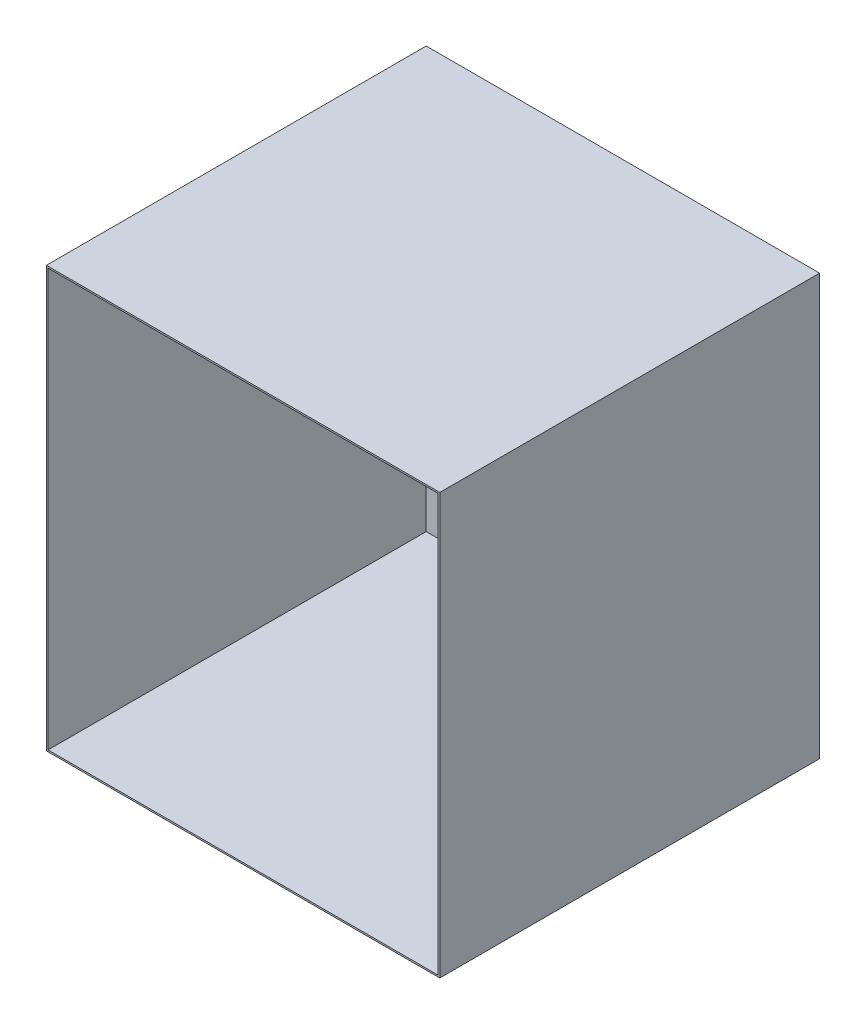
ISO-10303-21;
HEADER;
FILE_DESCRIPTION(('STEP AP214'),'2;1');
FILE_NAME('part.step','',(''),(''),'','','');
FILE_SCHEMA(('AUTOMOTIVE_DESIGN { 1 0 10303 214 1 1 1 1 }'));
ENDSEC;
DATA;
#1=APPLICATION_CONTEXT('core data for automotive mechanical design processes');
#2=APPLICATION_PROTOCOL_DEFINITION('international standard','automotive_design',2000,#1);
#3=PRODUCT_CONTEXT('',#1,'mechanical');
#4=PRODUCT('Part','Part','',(#3));
#5=PRODUCT_RELATED_PRODUCT_CATEGORY('part','',(#4));
#6=PRODUCT_DEFINITION_FORMATION('','',#4);
#7=PRODUCT_DEFINITION_CONTEXT('part definition',#1,'design');
#8=PRODUCT_DEFINITION('design','',#6,#7);
#9=PRODUCT_DEFINITION_SHAPE('','',#8);
#10=(LENGTH_UNIT() NAMED_UNIT(*) SI_UNIT(.MILLI.,.METRE.));
#11=(NAMED_UNIT(*) PLANE_ANGLE_UNIT() SI_UNIT($,.RADIAN.));
#12=(NAMED_UNIT(*) SI_UNIT($,.STERADIAN.) SOLID_ANGLE_UNIT());
#13=UNCERTAINTY_MEASURE_WITH_UNIT(LENGTH_MEASURE(1.E-05),#10,'distance_accuracy_value','');
#14=(GEOMETRIC_REPRESENTATION_CONTEXT(3) GLOBAL_UNCERTAINTY_ASSIGNED_CONTEXT((#13)) GLOBAL_UNIT_ASSIGNED_CONTEXT((#10,
#11,#12)) REPRESENTATION_CONTEXT('',''));
#15=CARTESIAN_POINT('',(0.,0.,0.));
#16=DIRECTION('',(0.,0.,1.));
#17=DIRECTION('',(1.,0.,0.));
#18=AXIS2_PLACEMENT_3D('',#15,#16,#17);
#19=CARTESIAN_POINT('',(0.,0.,280.));
#20=DIRECTION('',(0.,0.,-1.));
#21=DIRECTION('',(-1.,0.,0.));
#22=AXIS2_PLACEMENT_3D('',#19,#20,#21);
#23=PLANE('',#22);
#24=DIRECTION('',(0.,1.,0.));
#25=VECTOR('',#24,1.);
#26=CARTESIAN_POINT('',(145.,-155.,280.));
#27=LINE('',#26,#25);
#28=CARTESIAN_POINT('',(145.,-155.,280.));
#29=VERTEX_POINT('',#28);
#30=CARTESIAN_POINT('',(145.,155.,280.));
#31=VERTEX_POINT('',#30);
#32=EDGE_CURVE('E160',#29,#31,#27,.T.);
#33=ORIENTED_EDGE('',*,*,#32,.T.);
#34=DIRECTION('',(-1.,0.,0.));
#35=VECTOR('',#34,1.);
#36=CARTESIAN_POINT('',(-145.,155.,280.));
#37=LINE('',#36,#35);
#38=CARTESIAN_POINT('',(-145.,155.,280.));
#39=VERTEX_POINT('',#38);
#40=EDGE_CURVE('E164',#31,#39,#37,.T.);
#41=ORIENTED_EDGE('',*,*,#40,.T.);
#42=DIRECTION('',(0.,-1.,0.));
#43=VECTOR('',#42,1.);
#44=CARTESIAN_POINT('',(-145.,-155.,280.));
#45=LINE('',#44,#43);
#46=CARTESIAN_POINT('',(-145.,-155.,280.));
#47=VERTEX_POINT('',#46);
#48=EDGE_CURVE('E168',#39,#47,#45,.T.);
#49=ORIENTED_EDGE('',*,*,#48,.T.);
#50=DIRECTION('',(1.,0.,0.));
#51=VECTOR('',#50,1.);
#52=CARTESIAN_POINT('',(-145.,-155.,280.));
#53=LINE('',#52,#51);
#54=EDGE_CURVE('E171',#47,#29,#53,.T.);
#55=ORIENTED_EDGE('',*,*,#54,.T.);
#56=EDGE_LOOP('',(#33,#41,#49,#55));
#57=FACE_BOUND('',#56,.T.);
#58=DIRECTION('',(1.,0.,0.));
#59=VECTOR('',#58,1.);
#60=CARTESIAN_POINT('',(-143.8,-153.8,280.));
#61=LINE('',#60,#59);
#62=CARTESIAN_POINT('',(-143.8,-153.8,280.));
#63=VERTEX_POINT('',#62);
#64=CARTESIAN_POINT('',(143.8,-153.8,280.));
#65=VERTEX_POINT('',#64);
#66=EDGE_CURVE('E140',#63,#65,#61,.T.);
#67=ORIENTED_EDGE('',*,*,#66,.F.);
#68=DIRECTION('',(0.,-1.,0.));
#69=VECTOR('',#68,1.);
#70=CARTESIAN_POINT('',(-143.8,-153.8,280.));
#71=LINE('',#70,#69);
#72=CARTESIAN_POINT('',(-143.8,153.8,280.));
#73=VERTEX_POINT('',#72);
#74=EDGE_CURVE('E119',#73,#63,#71,.T.);
#75=ORIENTED_EDGE('',*,*,#74,.F.);
#76=DIRECTION('',(-1.,0.,0.));
#77=VECTOR('',#76,1.);
#78=CARTESIAN_POINT('',(-143.8,153.8,280.));
#79=LINE('',#78,#77);
#80=CARTESIAN_POINT('',(143.8,153.8,280.));
#81=VERTEX_POINT('',#80);
#82=EDGE_CURVE('E146',#81,#73,#79,.T.);
#83=ORIENTED_EDGE('',*,*,#82,.F.);
#84=DIRECTION('',(0.,1.,0.));
#85=VECTOR('',#84,1.);
#86=CARTESIAN_POINT('',(143.8,-153.8,280.));
#87=LINE('',#86,#85);
#88=EDGE_CURVE('E143',#65,#81,#87,.T.);
#89=ORIENTED_EDGE('',*,*,#88,.F.);
#90=EDGE_LOOP('',(#67,#75,#83,#89));
#91=FACE_BOUND('',#90,.T.);
#92=ADVANCED_FACE('F45',(#57,#91),#23,.F.);
#93=CARTESIAN_POINT('',(0.,0.,0.));
#94=DIRECTION('',(0.,0.,-1.));
#95=DIRECTION('',(-1.,0.,0.));
#96=AXIS2_PLACEMENT_3D('',#93,#94,#95);
#97=PLANE('',#96);
#98=DIRECTION('',(0.,1.,0.));
#99=VECTOR('',#98,1.);
#100=CARTESIAN_POINT('',(145.,-155.,0.));
#101=LINE('',#100,#99);
#102=CARTESIAN_POINT('',(145.,-155.,0.));
#103=VERTEX_POINT('',#102);
#104=CARTESIAN_POINT('',(145.,155.,0.));
#105=VERTEX_POINT('',#104);
#106=EDGE_CURVE('E159',#103,#105,#101,.T.);
#107=ORIENTED_EDGE('',*,*,#106,.F.);
#108=DIRECTION('',(1.,0.,0.));
#109=VECTOR('',#108,1.);
#110=CARTESIAN_POINT('',(-145.,-155.,0.));
#111=LINE('',#110,#109);
#112=CARTESIAN_POINT('',(-145.,-155.,0.));
#113=VERTEX_POINT('',#112);
#114=EDGE_CURVE('E165',#113,#103,#111,.T.);
#115=ORIENTED_EDGE('',*,*,#114,.F.);
#116=DIRECTION('',(0.,-1.,0.));
#117=VECTOR('',#116,1.);
#118=CARTESIAN_POINT('',(-145.,-155.,0.));
#119=LINE('',#118,#117);
#120=CARTESIAN_POINT('',(-145.,155.,0.));
#121=VERTEX_POINT('',#120);
#122=EDGE_CURVE('E181',#121,#113,#119,.T.);
#123=ORIENTED_EDGE('',*,*,#122,.F.);
#124=DIRECTION('',(-1.,0.,0.));
#125=VECTOR('',#124,1.);
#126=CARTESIAN_POINT('',(-145.,155.,0.));
#127=LINE('',#126,#125);
#128=EDGE_CURVE('E178',#105,#121,#127,.T.);
#129=ORIENTED_EDGE('',*,*,#128,.F.);
#130=EDGE_LOOP('',(#107,#115,#123,#129));
#131=FACE_BOUND('',#130,.T.);
#132=ADVANCED_FACE('F204',(#131),#97,.T.);
#133=CARTESIAN_POINT('',(145.,-155.,280.));
#134=DIRECTION('',(-1.,0.,0.));
#135=DIRECTION('',(0.,0.,1.));
#136=AXIS2_PLACEMENT_3D('',#133,#134,#135);
#137=PLANE('',#136);
#138=ORIENTED_EDGE('',*,*,#106,.T.);
#139=DIRECTION('',(0.,0.,-1.));
#140=VECTOR('',#139,1.);
#141=CARTESIAN_POINT('',(145.,155.,280.));
#142=LINE('',#141,#140);
#143=EDGE_CURVE('E11',#31,#105,#142,.T.);
#144=ORIENTED_EDGE('',*,*,#143,.F.);
#145=ORIENTED_EDGE('',*,*,#32,.F.);
#146=DIRECTION('',(0.,0.,-1.));
#147=VECTOR('',#146,1.);
#148=CARTESIAN_POINT('',(145.,-155.,280.));
#149=LINE('',#148,#147);
#150=EDGE_CURVE('E174',#29,#103,#149,.T.);
#151=ORIENTED_EDGE('',*,*,#150,.T.);
#152=EDGE_LOOP('',(#138,#144,#145,#151));
#153=FACE_BOUND('',#152,.T.);
#154=ADVANCED_FACE('F47',(#153),#137,.F.);
#155=CARTESIAN_POINT('',(-145.,155.,280.));
#156=DIRECTION('',(0.,-1.,0.));
#157=DIRECTION('',(0.,0.,-1.));
#158=AXIS2_PLACEMENT_3D('',#155,#156,#157);
#159=PLANE('',#158);
#160=ORIENTED_EDGE('',*,*,#128,.T.);
#161=DIRECTION('',(0.,0.,-1.));
#162=VECTOR('',#161,1.);
#163=CARTESIAN_POINT('',(-145.,155.,280.));
#164=LINE('',#163,#162);
#165=EDGE_CURVE('E54',#39,#121,#164,.T.);
#166=ORIENTED_EDGE('',*,*,#165,.F.);
#167=ORIENTED_EDGE('',*,*,#40,.F.);
#168=ORIENTED_EDGE('',*,*,#143,.T.);
#169=EDGE_LOOP('',(#160,#166,#167,#168));
#170=FACE_BOUND('',#169,.T.);
#171=ADVANCED_FACE('F214',(#170),#159,.F.);
#172=CARTESIAN_POINT('',(-145.,-155.,280.));
#173=DIRECTION('',(1.,0.,0.));
#174=DIRECTION('',(0.,0.,-1.));
#175=AXIS2_PLACEMENT_3D('',#172,#173,#174);
#176=PLANE('',#175);
#177=ORIENTED_EDGE('',*,*,#122,.T.);
#178=DIRECTION('',(0.,0.,-1.));
#179=VECTOR('',#178,1.);
#180=CARTESIAN_POINT('',(-145.,-155.,280.));
#181=LINE('',#180,#179);
#182=EDGE_CURVE('E189',#47,#113,#181,.T.);
#183=ORIENTED_EDGE('',*,*,#182,.F.);
#184=ORIENTED_EDGE('',*,*,#48,.F.);
#185=ORIENTED_EDGE('',*,*,#165,.T.);
#186=EDGE_LOOP('',(#177,#183,#184,#185));
#187=FACE_BOUND('',#186,.T.);
#188=ADVANCED_FACE('F198',(#187),#176,.F.);
#189=CARTESIAN_POINT('',(-145.,-155.,280.));
#190=DIRECTION('',(0.,1.,0.));
#191=DIRECTION('',(0.,0.,1.));
#192=AXIS2_PLACEMENT_3D('',#189,#190,#191);
#193=PLANE('',#192);
#194=ORIENTED_EDGE('',*,*,#114,.T.);
#195=ORIENTED_EDGE('',*,*,#150,.F.);
#196=ORIENTED_EDGE('',*,*,#54,.F.);
#197=ORIENTED_EDGE('',*,*,#182,.T.);
#198=EDGE_LOOP('',(#194,#195,#196,#197));
#199=FACE_BOUND('',#198,.T.);
#200=ADVANCED_FACE('F207',(#199),#193,.F.);
#201=CARTESIAN_POINT('',(-143.8,-153.8,280.));
#202=DIRECTION('',(0.,1.,0.));
#203=DIRECTION('',(0.,0.,1.));
#204=AXIS2_PLACEMENT_3D('',#201,#202,#203);
#205=PLANE('',#204);
#206=DIRECTION('',(1.,0.,0.));
#207=VECTOR('',#206,1.);
#208=CARTESIAN_POINT('',(0.,-153.8,1.2));
#209=LINE('',#208,#207);
#210=CARTESIAN_POINT('',(-143.8,-153.8,1.2));
#211=VERTEX_POINT('',#210);
#212=CARTESIAN_POINT('',(143.8,-153.8,1.19999999999998));
#213=VERTEX_POINT('',#212);
#214=EDGE_CURVE('E126',#211,#213,#209,.T.);
#215=ORIENTED_EDGE('',*,*,#214,.F.);
#216=DIRECTION('',(0.,0.,-1.));
#217=VECTOR('',#216,1.);
#218=CARTESIAN_POINT('',(-143.8,-153.8,280.));
#219=LINE('',#218,#217);
#220=EDGE_CURVE('E113',#63,#211,#219,.T.);
#221=ORIENTED_EDGE('',*,*,#220,.F.);
#222=ORIENTED_EDGE('',*,*,#66,.T.);
#223=DIRECTION('',(0.,0.,-1.));
#224=VECTOR('',#223,1.);
#225=CARTESIAN_POINT('',(143.8,-153.8,280.));
#226=LINE('',#225,#224);
#227=EDGE_CURVE('E128',#65,#213,#226,.T.);
#228=ORIENTED_EDGE('',*,*,#227,.T.);
#229=EDGE_LOOP('',(#215,#221,#222,#228));
#230=FACE_BOUND('',#229,.T.);
#231=ADVANCED_FACE('F127',(#230),#205,.T.);
#232=CARTESIAN_POINT('',(143.8,-153.8,280.));
#233=DIRECTION('',(-1.,0.,0.));
#234=DIRECTION('',(0.,0.,1.));
#235=AXIS2_PLACEMENT_3D('',#232,#233,#234);
#236=PLANE('',#235);
#237=DIRECTION('',(0.,1.,0.));
#238=VECTOR('',#237,1.);
#239=CARTESIAN_POINT('',(143.8,0.,1.2));
#240=LINE('',#239,#238);
#241=CARTESIAN_POINT('',(143.8,153.8,1.19999999999998));
#242=VERTEX_POINT('',#241);
#243=EDGE_CURVE('E61',#213,#242,#240,.T.);
#244=ORIENTED_EDGE('',*,*,#243,.F.);
#245=ORIENTED_EDGE('',*,*,#227,.F.);
#246=ORIENTED_EDGE('',*,*,#88,.T.);
#247=DIRECTION('',(0.,0.,-1.));
#248=VECTOR('',#247,1.);
#249=CARTESIAN_POINT('',(143.8,153.8,280.));
#250=LINE('',#249,#248);
#251=EDGE_CURVE('E154',#81,#242,#250,.T.);
#252=ORIENTED_EDGE('',*,*,#251,.T.);
#253=EDGE_LOOP('',(#244,#245,#246,#252));
#254=FACE_BOUND('',#253,.T.);
#255=ADVANCED_FACE('F234',(#254),#236,.T.);
#256=CARTESIAN_POINT('',(-143.8,153.8,280.));
#257=DIRECTION('',(0.,-1.,0.));
#258=DIRECTION('',(1.,0.,0.));
#259=AXIS2_PLACEMENT_3D('',#256,#257,#258);
#260=PLANE('',#259);
#261=DIRECTION('',(1.,0.,0.));
#262=VECTOR('',#261,1.);
#263=CARTESIAN_POINT('',(0.,153.8,1.2));
#264=LINE('',#263,#262);
#265=CARTESIAN_POINT('',(-143.8,153.8,1.19999999999998));
#266=VERTEX_POINT('',#265);
#267=EDGE_CURVE('E69',#266,#242,#264,.T.);
#268=ORIENTED_EDGE('',*,*,#267,.T.);
#269=ORIENTED_EDGE('',*,*,#251,.F.);
#270=ORIENTED_EDGE('',*,*,#82,.T.);
#271=DIRECTION('',(0.,0.,-1.));
#272=VECTOR('',#271,1.);
#273=CARTESIAN_POINT('',(-143.8,153.8,280.));
#274=LINE('',#273,#272);
#275=EDGE_CURVE('E123',#73,#266,#274,.T.);
#276=ORIENTED_EDGE('',*,*,#275,.T.);
#277=EDGE_LOOP('',(#268,#269,#270,#276));
#278=FACE_BOUND('',#277,.T.);
#279=ADVANCED_FACE('F238',(#278),#260,.T.);
#280=CARTESIAN_POINT('',(-143.8,-153.8,280.));
#281=DIRECTION('',(1.,0.,0.));
#282=DIRECTION('',(0.,0.,-1.));
#283=AXIS2_PLACEMENT_3D('',#280,#281,#282);
#284=PLANE('',#283);
#285=DIRECTION('',(0.,1.,0.));
#286=VECTOR('',#285,1.);
#287=CARTESIAN_POINT('',(-143.8,0.,1.2));
#288=LINE('',#287,#286);
#289=EDGE_CURVE('E117',#211,#266,#288,.T.);
#290=ORIENTED_EDGE('',*,*,#289,.T.);
#291=ORIENTED_EDGE('',*,*,#275,.F.);
#292=ORIENTED_EDGE('',*,*,#74,.T.);
#293=ORIENTED_EDGE('',*,*,#220,.T.);
#294=EDGE_LOOP('',(#290,#291,#292,#293));
#295=FACE_BOUND('',#294,.T.);
#296=ADVANCED_FACE('F115',(#295),#284,.T.);
#297=CARTESIAN_POINT('',(0.,0.,1.2));
#298=DIRECTION('',(0.,0.,1.));
#299=DIRECTION('',(1.,0.,0.));
#300=AXIS2_PLACEMENT_3D('',#297,#298,#299);
#301=PLANE('',#300);
#302=ORIENTED_EDGE('',*,*,#289,.F.);
#303=ORIENTED_EDGE('',*,*,#214,.T.);
#304=ORIENTED_EDGE('',*,*,#243,.T.);
#305=ORIENTED_EDGE('',*,*,#267,.F.);
#306=EDGE_LOOP('',(#302,#303,#304,#305));
#307=FACE_BOUND('',#306,.T.);
#308=ADVANCED_FACE('F132',(#307),#301,.T.);
#309=CLOSED_SHELL('',(#92,#132,#154,#171,#188,#200,#231,#255,#279,#296,#308));
#310=MANIFOLD_SOLID_BREP('B2',#309);
#311=ADVANCED_BREP_SHAPE_REPRESENTATION('',(#18,#310),#14);
#312=SHAPE_DEFINITION_REPRESENTATION(#9,#311);
ENDSEC;
END-ISO-10303-21;
